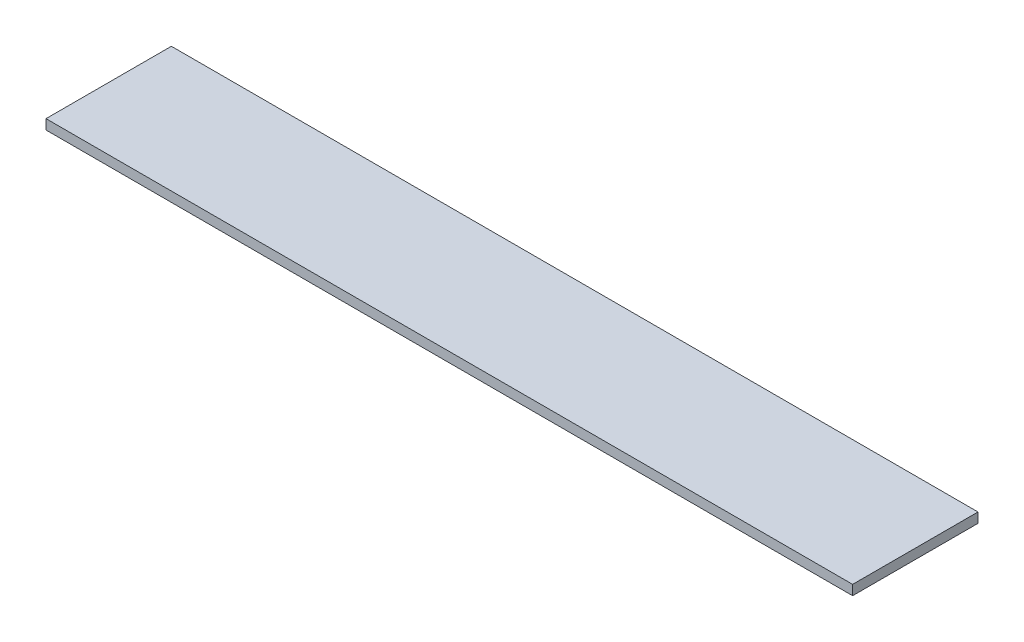
ISO-10303-21;
HEADER;
FILE_DESCRIPTION(('STEP AP214'),'2;1');
FILE_NAME('part.step','',(''),(''),'','','');
FILE_SCHEMA(('AUTOMOTIVE_DESIGN { 1 0 10303 214 1 1 1 1 }'));
ENDSEC;
DATA;
#1=APPLICATION_CONTEXT('core data for automotive mechanical design processes');
#2=APPLICATION_PROTOCOL_DEFINITION('international standard','automotive_design',2000,#1);
#3=PRODUCT_CONTEXT('',#1,'mechanical');
#4=PRODUCT('Part','Part','',(#3));
#5=PRODUCT_RELATED_PRODUCT_CATEGORY('part','',(#4));
#6=PRODUCT_DEFINITION_FORMATION('','',#4);
#7=PRODUCT_DEFINITION_CONTEXT('part definition',#1,'design');
#8=PRODUCT_DEFINITION('design','',#6,#7);
#9=PRODUCT_DEFINITION_SHAPE('','',#8);
#10=(LENGTH_UNIT() NAMED_UNIT(*) SI_UNIT(.MILLI.,.METRE.));
#11=(NAMED_UNIT(*) PLANE_ANGLE_UNIT() SI_UNIT($,.RADIAN.));
#12=(NAMED_UNIT(*) SI_UNIT($,.STERADIAN.) SOLID_ANGLE_UNIT());
#13=UNCERTAINTY_MEASURE_WITH_UNIT(LENGTH_MEASURE(1.E-05),#10,'distance_accuracy_value','');
#14=(GEOMETRIC_REPRESENTATION_CONTEXT(3) GLOBAL_UNCERTAINTY_ASSIGNED_CONTEXT((#13)) GLOBAL_UNIT_ASSIGNED_CONTEXT((#10,
#11,#12)) REPRESENTATION_CONTEXT('',''));
#15=CARTESIAN_POINT('',(0.,0.,0.));
#16=DIRECTION('',(0.,0.,1.));
#17=DIRECTION('',(1.,0.,0.));
#18=AXIS2_PLACEMENT_3D('',#15,#16,#17);
#19=CARTESIAN_POINT('',(81.715,2.,12.7));
#20=DIRECTION('',(-1.,0.,0.));
#21=DIRECTION('',(0.,0.,1.));
#22=AXIS2_PLACEMENT_3D('',#19,#20,#21);
#23=PLANE('',#22);
#24=DIRECTION('',(0.,0.,-1.));
#25=VECTOR('',#24,1.);
#26=CARTESIAN_POINT('',(81.715,0.,12.7));
#27=LINE('',#26,#25);
#28=CARTESIAN_POINT('',(81.715,0.,12.7));
#29=VERTEX_POINT('',#28);
#30=CARTESIAN_POINT('',(81.715,0.,-12.7));
#31=VERTEX_POINT('',#30);
#32=EDGE_CURVE('E102',#29,#31,#27,.T.);
#33=ORIENTED_EDGE('',*,*,#32,.T.);
#34=DIRECTION('',(0.,-1.,0.));
#35=VECTOR('',#34,1.);
#36=CARTESIAN_POINT('',(81.715,2.,-12.7));
#37=LINE('',#36,#35);
#38=CARTESIAN_POINT('',(81.715,2.,-12.7));
#39=VERTEX_POINT('',#38);
#40=EDGE_CURVE('E11',#39,#31,#37,.T.);
#41=ORIENTED_EDGE('',*,*,#40,.F.);
#42=DIRECTION('',(0.,0.,-1.));
#43=VECTOR('',#42,1.);
#44=CARTESIAN_POINT('',(81.715,2.,12.7));
#45=LINE('',#44,#43);
#46=CARTESIAN_POINT('',(81.715,2.,12.7));
#47=VERTEX_POINT('',#46);
#48=EDGE_CURVE('E90',#47,#39,#45,.T.);
#49=ORIENTED_EDGE('',*,*,#48,.F.);
#50=DIRECTION('',(0.,-1.,0.));
#51=VECTOR('',#50,1.);
#52=CARTESIAN_POINT('',(81.715,2.,12.7));
#53=LINE('',#52,#51);
#54=EDGE_CURVE('E98',#47,#29,#53,.T.);
#55=ORIENTED_EDGE('',*,*,#54,.T.);
#56=EDGE_LOOP('',(#33,#41,#49,#55));
#57=FACE_BOUND('',#56,.T.);
#58=ADVANCED_FACE('F39',(#57),#23,.F.);
#59=CARTESIAN_POINT('',(-81.715,2.,-12.7));
#60=DIRECTION('',(0.,0.,1.));
#61=DIRECTION('',(1.,0.,0.));
#62=AXIS2_PLACEMENT_3D('',#59,#60,#61);
#63=PLANE('',#62);
#64=DIRECTION('',(-1.,0.,0.));
#65=VECTOR('',#64,1.);
#66=CARTESIAN_POINT('',(-81.715,0.,-12.7));
#67=LINE('',#66,#65);
#68=CARTESIAN_POINT('',(-81.715,0.,-12.7));
#69=VERTEX_POINT('',#68);
#70=EDGE_CURVE('E94',#31,#69,#67,.T.);
#71=ORIENTED_EDGE('',*,*,#70,.T.);
#72=DIRECTION('',(0.,-1.,0.));
#73=VECTOR('',#72,1.);
#74=CARTESIAN_POINT('',(-81.715,2.,-12.7));
#75=LINE('',#74,#73);
#76=CARTESIAN_POINT('',(-81.715,2.,-12.7));
#77=VERTEX_POINT('',#76);
#78=EDGE_CURVE('E47',#77,#69,#75,.T.);
#79=ORIENTED_EDGE('',*,*,#78,.F.);
#80=DIRECTION('',(-1.,0.,0.));
#81=VECTOR('',#80,1.);
#82=CARTESIAN_POINT('',(-81.715,2.,-12.7));
#83=LINE('',#82,#81);
#84=EDGE_CURVE('E85',#39,#77,#83,.T.);
#85=ORIENTED_EDGE('',*,*,#84,.F.);
#86=ORIENTED_EDGE('',*,*,#40,.T.);
#87=EDGE_LOOP('',(#71,#79,#85,#86));
#88=FACE_BOUND('',#87,.T.);
#89=ADVANCED_FACE('F93',(#88),#63,.F.);
#90=CARTESIAN_POINT('',(-81.715,2.,12.7));
#91=DIRECTION('',(1.,0.,0.));
#92=DIRECTION('',(0.,0.,-1.));
#93=AXIS2_PLACEMENT_3D('',#90,#91,#92);
#94=PLANE('',#93);
#95=DIRECTION('',(0.,0.,1.));
#96=VECTOR('',#95,1.);
#97=CARTESIAN_POINT('',(-81.715,0.,12.7));
#98=LINE('',#97,#96);
#99=CARTESIAN_POINT('',(-81.715,0.,12.7));
#100=VERTEX_POINT('',#99);
#101=EDGE_CURVE('E72',#69,#100,#98,.T.);
#102=ORIENTED_EDGE('',*,*,#101,.T.);
#103=DIRECTION('',(0.,-1.,0.));
#104=VECTOR('',#103,1.);
#105=CARTESIAN_POINT('',(-81.715,2.,12.7));
#106=LINE('',#105,#104);
#107=CARTESIAN_POINT('',(-81.715,2.,12.7));
#108=VERTEX_POINT('',#107);
#109=EDGE_CURVE('E95',#108,#100,#106,.T.);
#110=ORIENTED_EDGE('',*,*,#109,.F.);
#111=DIRECTION('',(0.,0.,1.));
#112=VECTOR('',#111,1.);
#113=CARTESIAN_POINT('',(-81.715,2.,12.7));
#114=LINE('',#113,#112);
#115=EDGE_CURVE('E88',#77,#108,#114,.T.);
#116=ORIENTED_EDGE('',*,*,#115,.F.);
#117=ORIENTED_EDGE('',*,*,#78,.T.);
#118=EDGE_LOOP('',(#102,#110,#116,#117));
#119=FACE_BOUND('',#118,.T.);
#120=ADVANCED_FACE('F96',(#119),#94,.F.);
#121=CARTESIAN_POINT('',(-81.715,2.,12.7));
#122=DIRECTION('',(0.,0.,-1.));
#123=DIRECTION('',(-1.,0.,0.));
#124=AXIS2_PLACEMENT_3D('',#121,#122,#123);
#125=PLANE('',#124);
#126=DIRECTION('',(1.,0.,0.));
#127=VECTOR('',#126,1.);
#128=CARTESIAN_POINT('',(-81.715,0.,12.7));
#129=LINE('',#128,#127);
#130=EDGE_CURVE('E78',#100,#29,#129,.T.);
#131=ORIENTED_EDGE('',*,*,#130,.T.);
#132=ORIENTED_EDGE('',*,*,#54,.F.);
#133=DIRECTION('',(1.,0.,0.));
#134=VECTOR('',#133,1.);
#135=CARTESIAN_POINT('',(-81.715,2.,12.7));
#136=LINE('',#135,#134);
#137=EDGE_CURVE('E55',#108,#47,#136,.T.);
#138=ORIENTED_EDGE('',*,*,#137,.F.);
#139=ORIENTED_EDGE('',*,*,#109,.T.);
#140=EDGE_LOOP('',(#131,#132,#138,#139));
#141=FACE_BOUND('',#140,.T.);
#142=ADVANCED_FACE('F109',(#141),#125,.F.);
#143=CARTESIAN_POINT('',(0.,2.,0.));
#144=DIRECTION('',(0.,-1.,0.));
#145=DIRECTION('',(0.,0.,-1.));
#146=AXIS2_PLACEMENT_3D('',#143,#144,#145);
#147=PLANE('',#146);
#148=ORIENTED_EDGE('',*,*,#48,.T.);
#149=ORIENTED_EDGE('',*,*,#84,.T.);
#150=ORIENTED_EDGE('',*,*,#115,.T.);
#151=ORIENTED_EDGE('',*,*,#137,.T.);
#152=EDGE_LOOP('',(#148,#149,#150,#151));
#153=FACE_BOUND('',#152,.T.);
#154=ADVANCED_FACE('F86',(#153),#147,.F.);
#155=CARTESIAN_POINT('',(0.,0.,0.));
#156=DIRECTION('',(0.,-1.,0.));
#157=DIRECTION('',(0.,0.,-1.));
#158=AXIS2_PLACEMENT_3D('',#155,#156,#157);
#159=PLANE('',#158);
#160=ORIENTED_EDGE('',*,*,#32,.F.);
#161=ORIENTED_EDGE('',*,*,#130,.F.);
#162=ORIENTED_EDGE('',*,*,#101,.F.);
#163=ORIENTED_EDGE('',*,*,#70,.F.);
#164=EDGE_LOOP('',(#160,#161,#162,#163));
#165=FACE_BOUND('',#164,.T.);
#166=ADVANCED_FACE('F112',(#165),#159,.T.);
#167=CLOSED_SHELL('',(#58,#89,#120,#142,#154,#166));
#168=MANIFOLD_SOLID_BREP('B2',#167);
#169=ADVANCED_BREP_SHAPE_REPRESENTATION('',(#18,#168),#14);
#170=SHAPE_DEFINITION_REPRESENTATION(#9,#169);
ENDSEC;
END-ISO-10303-21;
